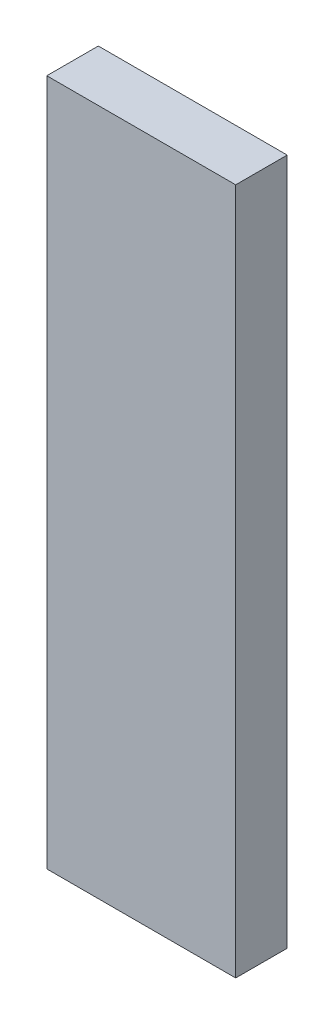
ISO-10303-21;
HEADER;
FILE_DESCRIPTION(('STEP AP214'),'2;1');
FILE_NAME('part.step','',(''),(''),'','','');
FILE_SCHEMA(('AUTOMOTIVE_DESIGN { 1 0 10303 214 1 1 1 1 }'));
ENDSEC;
DATA;
#1=APPLICATION_CONTEXT('core data for automotive mechanical design processes');
#2=APPLICATION_PROTOCOL_DEFINITION('international standard','automotive_design',2000,#1);
#3=PRODUCT_CONTEXT('',#1,'mechanical');
#4=PRODUCT('Part','Part','',(#3));
#5=PRODUCT_RELATED_PRODUCT_CATEGORY('part','',(#4));
#6=PRODUCT_DEFINITION_FORMATION('','',#4);
#7=PRODUCT_DEFINITION_CONTEXT('part definition',#1,'design');
#8=PRODUCT_DEFINITION('design','',#6,#7);
#9=PRODUCT_DEFINITION_SHAPE('','',#8);
#10=(LENGTH_UNIT() NAMED_UNIT(*) SI_UNIT(.MILLI.,.METRE.));
#11=(NAMED_UNIT(*) PLANE_ANGLE_UNIT() SI_UNIT($,.RADIAN.));
#12=(NAMED_UNIT(*) SI_UNIT($,.STERADIAN.) SOLID_ANGLE_UNIT());
#13=UNCERTAINTY_MEASURE_WITH_UNIT(LENGTH_MEASURE(1.E-05),#10,'distance_accuracy_value','');
#14=(GEOMETRIC_REPRESENTATION_CONTEXT(3) GLOBAL_UNCERTAINTY_ASSIGNED_CONTEXT((#13)) GLOBAL_UNIT_ASSIGNED_CONTEXT((#10,
#11,#12)) REPRESENTATION_CONTEXT('',''));
#15=CARTESIAN_POINT('',(0.,0.,0.));
#16=DIRECTION('',(0.,0.,1.));
#17=DIRECTION('',(1.,0.,0.));
#18=AXIS2_PLACEMENT_3D('',#15,#16,#17);
#19=CARTESIAN_POINT('',(0.,0.,3.));
#20=DIRECTION('',(1.,0.,0.));
#21=DIRECTION('',(0.,0.,-1.));
#22=AXIS2_PLACEMENT_3D('',#19,#20,#21);
#23=PLANE('',#22);
#24=DIRECTION('',(0.,-1.,0.));
#25=VECTOR('',#24,1.);
#26=CARTESIAN_POINT('',(0.,0.,0.));
#27=LINE('',#26,#25);
#28=CARTESIAN_POINT('',(0.,40.,0.));
#29=VERTEX_POINT('',#28);
#30=CARTESIAN_POINT('',(0.,0.,0.));
#31=VERTEX_POINT('',#30);
#32=EDGE_CURVE('E95',#29,#31,#27,.T.);
#33=ORIENTED_EDGE('',*,*,#32,.T.);
#34=DIRECTION('',(0.,0.,-1.));
#35=VECTOR('',#34,1.);
#36=CARTESIAN_POINT('',(0.,0.,3.));
#37=LINE('',#36,#35);
#38=CARTESIAN_POINT('',(0.,0.,3.));
#39=VERTEX_POINT('',#38);
#40=EDGE_CURVE('E11',#39,#31,#37,.T.);
#41=ORIENTED_EDGE('',*,*,#40,.F.);
#42=DIRECTION('',(0.,-1.,0.));
#43=VECTOR('',#42,1.);
#44=CARTESIAN_POINT('',(0.,0.,3.));
#45=LINE('',#44,#43);
#46=CARTESIAN_POINT('',(0.,40.,3.));
#47=VERTEX_POINT('',#46);
#48=EDGE_CURVE('E83',#47,#39,#45,.T.);
#49=ORIENTED_EDGE('',*,*,#48,.F.);
#50=DIRECTION('',(0.,0.,-1.));
#51=VECTOR('',#50,1.);
#52=CARTESIAN_POINT('',(0.,40.,3.));
#53=LINE('',#52,#51);
#54=EDGE_CURVE('E91',#47,#29,#53,.T.);
#55=ORIENTED_EDGE('',*,*,#54,.T.);
#56=EDGE_LOOP('',(#33,#41,#49,#55));
#57=FACE_BOUND('',#56,.T.);
#58=ADVANCED_FACE('F32',(#57),#23,.F.);
#59=CARTESIAN_POINT('',(0.,0.,3.));
#60=DIRECTION('',(0.,1.,0.));
#61=DIRECTION('',(0.,0.,1.));
#62=AXIS2_PLACEMENT_3D('',#59,#60,#61);
#63=PLANE('',#62);
#64=DIRECTION('',(1.,0.,0.));
#65=VECTOR('',#64,1.);
#66=CARTESIAN_POINT('',(0.,0.,0.));
#67=LINE('',#66,#65);
#68=CARTESIAN_POINT('',(11.,0.,0.));
#69=VERTEX_POINT('',#68);
#70=EDGE_CURVE('E87',#31,#69,#67,.T.);
#71=ORIENTED_EDGE('',*,*,#70,.T.);
#72=DIRECTION('',(0.,0.,-1.));
#73=VECTOR('',#72,1.);
#74=CARTESIAN_POINT('',(11.,0.,3.));
#75=LINE('',#74,#73);
#76=CARTESIAN_POINT('',(11.,0.,3.));
#77=VERTEX_POINT('',#76);
#78=EDGE_CURVE('E40',#77,#69,#75,.T.);
#79=ORIENTED_EDGE('',*,*,#78,.F.);
#80=DIRECTION('',(1.,0.,0.));
#81=VECTOR('',#80,1.);
#82=CARTESIAN_POINT('',(0.,0.,3.));
#83=LINE('',#82,#81);
#84=EDGE_CURVE('E78',#39,#77,#83,.T.);
#85=ORIENTED_EDGE('',*,*,#84,.F.);
#86=ORIENTED_EDGE('',*,*,#40,.T.);
#87=EDGE_LOOP('',(#71,#79,#85,#86));
#88=FACE_BOUND('',#87,.T.);
#89=ADVANCED_FACE('F86',(#88),#63,.F.);
#90=CARTESIAN_POINT('',(11.,0.,3.));
#91=DIRECTION('',(-1.,0.,0.));
#92=DIRECTION('',(0.,0.,1.));
#93=AXIS2_PLACEMENT_3D('',#90,#91,#92);
#94=PLANE('',#93);
#95=DIRECTION('',(0.,1.,0.));
#96=VECTOR('',#95,1.);
#97=CARTESIAN_POINT('',(11.,0.,0.));
#98=LINE('',#97,#96);
#99=CARTESIAN_POINT('',(11.,40.,0.));
#100=VERTEX_POINT('',#99);
#101=EDGE_CURVE('E65',#69,#100,#98,.T.);
#102=ORIENTED_EDGE('',*,*,#101,.T.);
#103=DIRECTION('',(0.,0.,-1.));
#104=VECTOR('',#103,1.);
#105=CARTESIAN_POINT('',(11.,40.,3.));
#106=LINE('',#105,#104);
#107=CARTESIAN_POINT('',(11.,40.,3.));
#108=VERTEX_POINT('',#107);
#109=EDGE_CURVE('E88',#108,#100,#106,.T.);
#110=ORIENTED_EDGE('',*,*,#109,.F.);
#111=DIRECTION('',(0.,1.,0.));
#112=VECTOR('',#111,1.);
#113=CARTESIAN_POINT('',(11.,0.,3.));
#114=LINE('',#113,#112);
#115=EDGE_CURVE('E81',#77,#108,#114,.T.);
#116=ORIENTED_EDGE('',*,*,#115,.F.);
#117=ORIENTED_EDGE('',*,*,#78,.T.);
#118=EDGE_LOOP('',(#102,#110,#116,#117));
#119=FACE_BOUND('',#118,.T.);
#120=ADVANCED_FACE('F89',(#119),#94,.F.);
#121=CARTESIAN_POINT('',(0.,40.,3.));
#122=DIRECTION('',(0.,-1.,0.));
#123=DIRECTION('',(0.,0.,-1.));
#124=AXIS2_PLACEMENT_3D('',#121,#122,#123);
#125=PLANE('',#124);
#126=DIRECTION('',(-1.,0.,0.));
#127=VECTOR('',#126,1.);
#128=CARTESIAN_POINT('',(0.,40.,0.));
#129=LINE('',#128,#127);
#130=EDGE_CURVE('E71',#100,#29,#129,.T.);
#131=ORIENTED_EDGE('',*,*,#130,.T.);
#132=ORIENTED_EDGE('',*,*,#54,.F.);
#133=DIRECTION('',(-1.,0.,0.));
#134=VECTOR('',#133,1.);
#135=CARTESIAN_POINT('',(0.,40.,3.));
#136=LINE('',#135,#134);
#137=EDGE_CURVE('E48',#108,#47,#136,.T.);
#138=ORIENTED_EDGE('',*,*,#137,.F.);
#139=ORIENTED_EDGE('',*,*,#109,.T.);
#140=EDGE_LOOP('',(#131,#132,#138,#139));
#141=FACE_BOUND('',#140,.T.);
#142=ADVANCED_FACE('F102',(#141),#125,.F.);
#143=CARTESIAN_POINT('',(0.,0.,3.));
#144=DIRECTION('',(0.,0.,-1.));
#145=DIRECTION('',(-1.,0.,0.));
#146=AXIS2_PLACEMENT_3D('',#143,#144,#145);
#147=PLANE('',#146);
#148=ORIENTED_EDGE('',*,*,#48,.T.);
#149=ORIENTED_EDGE('',*,*,#84,.T.);
#150=ORIENTED_EDGE('',*,*,#115,.T.);
#151=ORIENTED_EDGE('',*,*,#137,.T.);
#152=EDGE_LOOP('',(#148,#149,#150,#151));
#153=FACE_BOUND('',#152,.T.);
#154=ADVANCED_FACE('F79',(#153),#147,.F.);
#155=CARTESIAN_POINT('',(0.,0.,0.));
#156=DIRECTION('',(0.,0.,-1.));
#157=DIRECTION('',(-1.,0.,0.));
#158=AXIS2_PLACEMENT_3D('',#155,#156,#157);
#159=PLANE('',#158);
#160=ORIENTED_EDGE('',*,*,#32,.F.);
#161=ORIENTED_EDGE('',*,*,#130,.F.);
#162=ORIENTED_EDGE('',*,*,#101,.F.);
#163=ORIENTED_EDGE('',*,*,#70,.F.);
#164=EDGE_LOOP('',(#160,#161,#162,#163));
#165=FACE_BOUND('',#164,.T.);
#166=ADVANCED_FACE('F105',(#165),#159,.T.);
#167=CLOSED_SHELL('',(#58,#89,#120,#142,#154,#166));
#168=MANIFOLD_SOLID_BREP('B2',#167);
#169=ADVANCED_BREP_SHAPE_REPRESENTATION('',(#18,#168),#14);
#170=SHAPE_DEFINITION_REPRESENTATION(#9,#169);
ENDSEC;
END-ISO-10303-21;
